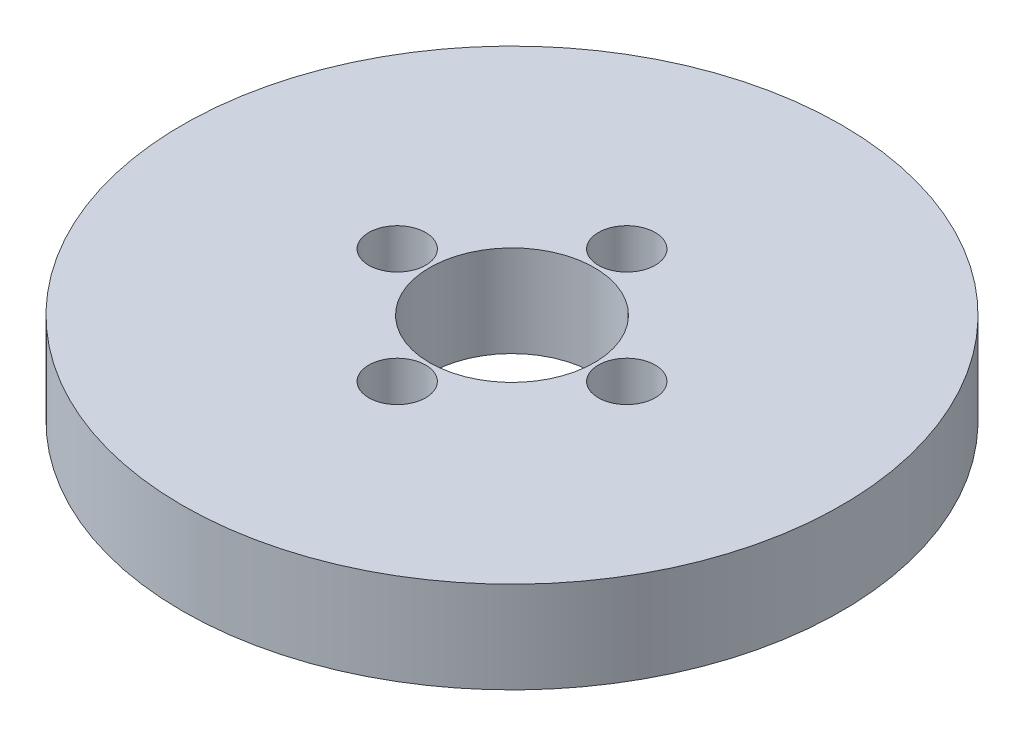
ISO-10303-21;
HEADER;
FILE_DESCRIPTION(('STEP AP214'),'2;1');
FILE_NAME('part.step','',(''),(''),'','','');
FILE_SCHEMA(('AUTOMOTIVE_DESIGN { 1 0 10303 214 1 1 1 1 }'));
ENDSEC;
DATA;
#1=APPLICATION_CONTEXT('core data for automotive mechanical design processes');
#2=APPLICATION_PROTOCOL_DEFINITION('international standard','automotive_design',2000,#1);
#3=PRODUCT_CONTEXT('',#1,'mechanical');
#4=PRODUCT('Part','Part','',(#3));
#5=PRODUCT_RELATED_PRODUCT_CATEGORY('part','',(#4));
#6=PRODUCT_DEFINITION_FORMATION('','',#4);
#7=PRODUCT_DEFINITION_CONTEXT('part definition',#1,'design');
#8=PRODUCT_DEFINITION('design','',#6,#7);
#9=PRODUCT_DEFINITION_SHAPE('','',#8);
#10=(LENGTH_UNIT() NAMED_UNIT(*) SI_UNIT(.MILLI.,.METRE.));
#11=(NAMED_UNIT(*) PLANE_ANGLE_UNIT() SI_UNIT($,.RADIAN.));
#12=(NAMED_UNIT(*) SI_UNIT($,.STERADIAN.) SOLID_ANGLE_UNIT());
#13=UNCERTAINTY_MEASURE_WITH_UNIT(LENGTH_MEASURE(1.E-05),#10,'distance_accuracy_value','');
#14=(GEOMETRIC_REPRESENTATION_CONTEXT(3) GLOBAL_UNCERTAINTY_ASSIGNED_CONTEXT((#13)) GLOBAL_UNIT_ASSIGNED_CONTEXT((#10,
#11,#12)) REPRESENTATION_CONTEXT('',''));
#15=CARTESIAN_POINT('',(0.,0.,0.));
#16=DIRECTION('',(0.,0.,1.));
#17=DIRECTION('',(1.,0.,0.));
#18=AXIS2_PLACEMENT_3D('',#15,#16,#17);
#19=CARTESIAN_POINT('',(0.,25.,0.));
#20=DIRECTION('',(0.,-1.,0.));
#21=DIRECTION('',(0.,0.,-1.));
#22=AXIS2_PLACEMENT_3D('',#19,#20,#21);
#23=CYLINDRICAL_SURFACE('',#22,90.);
#24=CARTESIAN_POINT('',(0.,25.,0.));
#25=DIRECTION('',(0.,1.,0.));
#26=DIRECTION('',(0.,0.,1.));
#27=AXIS2_PLACEMENT_3D('',#24,#25,#26);
#28=CIRCLE('',#27,90.);
#29=CARTESIAN_POINT('',(0.,25.,90.));
#30=VERTEX_POINT('',#29);
#31=EDGE_CURVE('E10',#30,#30,#28,.T.);
#32=ORIENTED_EDGE('',*,*,#31,.F.);
#33=EDGE_LOOP('',(#32));
#34=FACE_BOUND('',#33,.T.);
#35=CARTESIAN_POINT('',(0.,0.,0.));
#36=DIRECTION('',(0.,1.,0.));
#37=DIRECTION('',(0.,0.,1.));
#38=AXIS2_PLACEMENT_3D('',#35,#36,#37);
#39=CIRCLE('',#38,90.);
#40=CARTESIAN_POINT('',(0.,0.,90.));
#41=VERTEX_POINT('',#40);
#42=EDGE_CURVE('E37',#41,#41,#39,.T.);
#43=ORIENTED_EDGE('',*,*,#42,.T.);
#44=EDGE_LOOP('',(#43));
#45=FACE_BOUND('',#44,.T.);
#46=ADVANCED_FACE('F40',(#34,#45),#23,.T.);
#47=CARTESIAN_POINT('',(0.,25.,0.));
#48=DIRECTION('',(0.,1.,0.));
#49=DIRECTION('',(0.,0.,1.));
#50=AXIS2_PLACEMENT_3D('',#47,#48,#49);
#51=PLANE('',#50);
#52=CARTESIAN_POINT('',(1.09437481990576E-13,25.,31.3441406010312));
#53=DIRECTION('',(0.,1.,0.));
#54=DIRECTION('',(1.,0.,0.));
#55=AXIS2_PLACEMENT_3D('',#52,#53,#54);
#56=CIRCLE('',#55,7.76397000494948);
#57=CARTESIAN_POINT('',(7.76397000494958,25.,31.3441406010312));
#58=VERTEX_POINT('',#57);
#59=EDGE_CURVE('E71',#58,#58,#56,.T.);
#60=ORIENTED_EDGE('',*,*,#59,.F.);
#61=EDGE_LOOP('',(#60));
#62=FACE_BOUND('',#61,.T.);
#63=CARTESIAN_POINT('',(31.3441406010312,25.,0.));
#64=DIRECTION('',(0.,1.,0.));
#65=DIRECTION('',(0.,0.,-1.));
#66=AXIS2_PLACEMENT_3D('',#63,#64,#65);
#67=CIRCLE('',#66,7.76397000494948);
#68=CARTESIAN_POINT('',(31.3441406010312,25.,-7.76397000494948));
#69=VERTEX_POINT('',#68);
#70=EDGE_CURVE('E70',#69,#69,#67,.T.);
#71=ORIENTED_EDGE('',*,*,#70,.F.);
#72=EDGE_LOOP('',(#71));
#73=FACE_BOUND('',#72,.T.);
#74=CARTESIAN_POINT('',(-3.28312445971727E-13,25.,-31.3441406010312));
#75=DIRECTION('',(0.,1.,0.));
#76=DIRECTION('',(-1.,0.,0.));
#77=AXIS2_PLACEMENT_3D('',#74,#75,#76);
#78=CIRCLE('',#77,7.76397000494948);
#79=CARTESIAN_POINT('',(-7.7639700049498,25.,-31.3441406010311));
#80=VERTEX_POINT('',#79);
#81=EDGE_CURVE('E61',#80,#80,#78,.T.);
#82=ORIENTED_EDGE('',*,*,#81,.F.);
#83=EDGE_LOOP('',(#82));
#84=FACE_BOUND('',#83,.T.);
#85=CARTESIAN_POINT('',(-31.3441406010312,25.,0.));
#86=DIRECTION('',(0.,1.,0.));
#87=DIRECTION('',(0.,0.,1.));
#88=AXIS2_PLACEMENT_3D('',#85,#86,#87);
#89=CIRCLE('',#88,7.76397000494948);
#90=CARTESIAN_POINT('',(-31.3441406010312,25.,7.76397000494948));
#91=VERTEX_POINT('',#90);
#92=EDGE_CURVE('E54',#91,#91,#89,.T.);
#93=ORIENTED_EDGE('',*,*,#92,.F.);
#94=EDGE_LOOP('',(#93));
#95=FACE_BOUND('',#94,.T.);
#96=CARTESIAN_POINT('',(0.,25.,0.));
#97=DIRECTION('',(0.,1.,0.));
#98=DIRECTION('',(0.,0.,1.));
#99=AXIS2_PLACEMENT_3D('',#96,#97,#98);
#100=CIRCLE('',#99,22.5);
#101=CARTESIAN_POINT('',(0.,25.,22.5));
#102=VERTEX_POINT('',#101);
#103=EDGE_CURVE('E50',#102,#102,#100,.T.);
#104=ORIENTED_EDGE('',*,*,#103,.F.);
#105=EDGE_LOOP('',(#104));
#106=FACE_BOUND('',#105,.T.);
#107=ORIENTED_EDGE('',*,*,#31,.T.);
#108=EDGE_LOOP('',(#107));
#109=FACE_BOUND('',#108,.T.);
#110=ADVANCED_FACE('F86',(#62,#73,#84,#95,#106,#109),#51,.T.);
#111=CARTESIAN_POINT('',(0.,0.,0.));
#112=DIRECTION('',(0.,1.,0.));
#113=DIRECTION('',(0.,0.,1.));
#114=AXIS2_PLACEMENT_3D('',#111,#112,#113);
#115=PLANE('',#114);
#116=CARTESIAN_POINT('',(0.,0.,0.));
#117=DIRECTION('',(0.,1.,0.));
#118=DIRECTION('',(0.,0.,1.));
#119=AXIS2_PLACEMENT_3D('',#116,#117,#118);
#120=CIRCLE('',#119,22.5);
#121=CARTESIAN_POINT('',(0.,0.,22.5));
#122=VERTEX_POINT('',#121);
#123=EDGE_CURVE('E47',#122,#122,#120,.T.);
#124=ORIENTED_EDGE('',*,*,#123,.T.);
#125=EDGE_LOOP('',(#124));
#126=FACE_BOUND('',#125,.T.);
#127=ORIENTED_EDGE('',*,*,#42,.F.);
#128=EDGE_LOOP('',(#127));
#129=FACE_BOUND('',#128,.T.);
#130=ADVANCED_FACE('F93',(#126,#129),#115,.F.);
#131=CARTESIAN_POINT('',(0.,25.,0.));
#132=DIRECTION('',(0.,-1.,0.));
#133=DIRECTION('',(0.,0.,-1.));
#134=AXIS2_PLACEMENT_3D('',#131,#132,#133);
#135=CYLINDRICAL_SURFACE('',#134,22.5);
#136=ORIENTED_EDGE('',*,*,#103,.T.);
#137=EDGE_LOOP('',(#136));
#138=FACE_BOUND('',#137,.T.);
#139=ORIENTED_EDGE('',*,*,#123,.F.);
#140=EDGE_LOOP('',(#139));
#141=FACE_BOUND('',#140,.T.);
#142=ADVANCED_FACE('F101',(#138,#141),#135,.F.);
#143=CARTESIAN_POINT('',(-31.3441406010312,1.6092043315941,0.));
#144=DIRECTION('',(0.,1.,0.));
#145=DIRECTION('',(0.,0.,1.));
#146=AXIS2_PLACEMENT_3D('',#143,#144,#145);
#147=CYLINDRICAL_SURFACE('',#146,7.76397000494948);
#148=CARTESIAN_POINT('',(-31.3441406010312,1.6092043315941,0.));
#149=DIRECTION('',(0.,1.,0.));
#150=DIRECTION('',(0.,0.,1.));
#151=AXIS2_PLACEMENT_3D('',#148,#149,#150);
#152=CIRCLE('',#151,7.76397000494948);
#153=CARTESIAN_POINT('',(-31.3441406010312,1.6092043315941,7.76397000494948));
#154=VERTEX_POINT('',#153);
#155=EDGE_CURVE('E55',#154,#154,#152,.T.);
#156=ORIENTED_EDGE('',*,*,#155,.F.);
#157=EDGE_LOOP('',(#156));
#158=FACE_BOUND('',#157,.T.);
#159=ORIENTED_EDGE('',*,*,#92,.T.);
#160=EDGE_LOOP('',(#159));
#161=FACE_BOUND('',#160,.T.);
#162=ADVANCED_FACE('F102',(#158,#161),#147,.F.);
#163=CARTESIAN_POINT('',(-31.3441406010312,1.6092043315941,0.));
#164=DIRECTION('',(0.,1.,0.));
#165=DIRECTION('',(0.,0.,1.));
#166=AXIS2_PLACEMENT_3D('',#163,#164,#165);
#167=PLANE('',#166);
#168=ORIENTED_EDGE('',*,*,#155,.T.);
#169=EDGE_LOOP('',(#168));
#170=FACE_BOUND('',#169,.T.);
#171=ADVANCED_FACE('F133',(#170),#167,.T.);
#172=CARTESIAN_POINT('',(-3.28312445971727E-13,1.6092043315941,-31.3441406010312));
#173=DIRECTION('',(0.,1.,0.));
#174=DIRECTION('',(0.,0.,1.));
#175=AXIS2_PLACEMENT_3D('',#172,#173,#174);
#176=CYLINDRICAL_SURFACE('',#175,7.76397000494948);
#177=CARTESIAN_POINT('',(-3.28312445971727E-13,1.6092043315941,-31.3441406010312));
#178=DIRECTION('',(0.,1.,0.));
#179=DIRECTION('',(-1.,0.,0.));
#180=AXIS2_PLACEMENT_3D('',#177,#178,#179);
#181=CIRCLE('',#180,7.76397000494948);
#182=CARTESIAN_POINT('',(-7.7639700049498,1.6092043315941,-31.3441406010311));
#183=VERTEX_POINT('',#182);
#184=EDGE_CURVE('E63',#183,#183,#181,.T.);
#185=ORIENTED_EDGE('',*,*,#184,.F.);
#186=EDGE_LOOP('',(#185));
#187=FACE_BOUND('',#186,.T.);
#188=ORIENTED_EDGE('',*,*,#81,.T.);
#189=EDGE_LOOP('',(#188));
#190=FACE_BOUND('',#189,.T.);
#191=ADVANCED_FACE('F142',(#187,#190),#176,.F.);
#192=CARTESIAN_POINT('',(-3.28312445971727E-13,1.6092043315941,-31.3441406010312));
#193=DIRECTION('',(0.,1.,0.));
#194=DIRECTION('',(-1.,0.,0.));
#195=AXIS2_PLACEMENT_3D('',#192,#193,#194);
#196=PLANE('',#195);
#197=ORIENTED_EDGE('',*,*,#184,.T.);
#198=EDGE_LOOP('',(#197));
#199=FACE_BOUND('',#198,.T.);
#200=ADVANCED_FACE('F156',(#199),#196,.T.);
#201=CARTESIAN_POINT('',(31.3441406010312,1.6092043315941,0.));
#202=DIRECTION('',(0.,1.,0.));
#203=DIRECTION('',(0.,0.,1.));
#204=AXIS2_PLACEMENT_3D('',#201,#202,#203);
#205=CYLINDRICAL_SURFACE('',#204,7.76397000494948);
#206=CARTESIAN_POINT('',(31.3441406010312,1.6092043315941,0.));
#207=DIRECTION('',(0.,1.,0.));
#208=DIRECTION('',(0.,0.,-1.));
#209=AXIS2_PLACEMENT_3D('',#206,#207,#208);
#210=CIRCLE('',#209,7.76397000494948);
#211=CARTESIAN_POINT('',(31.3441406010312,1.6092043315941,-7.76397000494948));
#212=VERTEX_POINT('',#211);
#213=EDGE_CURVE('E69',#212,#212,#210,.T.);
#214=ORIENTED_EDGE('',*,*,#213,.F.);
#215=EDGE_LOOP('',(#214));
#216=FACE_BOUND('',#215,.T.);
#217=ORIENTED_EDGE('',*,*,#70,.T.);
#218=EDGE_LOOP('',(#217));
#219=FACE_BOUND('',#218,.T.);
#220=ADVANCED_FACE('F164',(#216,#219),#205,.F.);
#221=CARTESIAN_POINT('',(31.3441406010312,1.6092043315941,0.));
#222=DIRECTION('',(0.,1.,0.));
#223=DIRECTION('',(0.,0.,-1.));
#224=AXIS2_PLACEMENT_3D('',#221,#222,#223);
#225=PLANE('',#224);
#226=ORIENTED_EDGE('',*,*,#213,.T.);
#227=EDGE_LOOP('',(#226));
#228=FACE_BOUND('',#227,.T.);
#229=ADVANCED_FACE('F83',(#228),#225,.T.);
#230=CARTESIAN_POINT('',(1.09437481990576E-13,1.6092043315941,31.3441406010312));
#231=DIRECTION('',(0.,1.,0.));
#232=DIRECTION('',(0.,0.,1.));
#233=AXIS2_PLACEMENT_3D('',#230,#231,#232);
#234=CYLINDRICAL_SURFACE('',#233,7.76397000494948);
#235=CARTESIAN_POINT('',(1.09437481990576E-13,1.6092043315941,31.3441406010312));
#236=DIRECTION('',(0.,1.,0.));
#237=DIRECTION('',(1.,0.,0.));
#238=AXIS2_PLACEMENT_3D('',#235,#236,#237);
#239=CIRCLE('',#238,7.76397000494948);
#240=CARTESIAN_POINT('',(7.76397000494958,1.6092043315941,31.3441406010312));
#241=VERTEX_POINT('',#240);
#242=EDGE_CURVE('E59',#241,#241,#239,.T.);
#243=ORIENTED_EDGE('',*,*,#242,.F.);
#244=EDGE_LOOP('',(#243));
#245=FACE_BOUND('',#244,.T.);
#246=ORIENTED_EDGE('',*,*,#59,.T.);
#247=EDGE_LOOP('',(#246));
#248=FACE_BOUND('',#247,.T.);
#249=ADVANCED_FACE('F81',(#245,#248),#234,.F.);
#250=CARTESIAN_POINT('',(1.09437481990576E-13,1.6092043315941,31.3441406010312));
#251=DIRECTION('',(0.,1.,0.));
#252=DIRECTION('',(1.,0.,0.));
#253=AXIS2_PLACEMENT_3D('',#250,#251,#252);
#254=PLANE('',#253);
#255=ORIENTED_EDGE('',*,*,#242,.T.);
#256=EDGE_LOOP('',(#255));
#257=FACE_BOUND('',#256,.T.);
#258=ADVANCED_FACE('F78',(#257),#254,.T.);
#259=CLOSED_SHELL('',(#46,#110,#130,#142,#162,#171,#191,#200,#220,#229,#249,#258));
#260=MANIFOLD_SOLID_BREP('B2',#259);
#261=ADVANCED_BREP_SHAPE_REPRESENTATION('',(#18,#260),#14);
#262=SHAPE_DEFINITION_REPRESENTATION(#9,#261);
ENDSEC;
END-ISO-10303-21;
